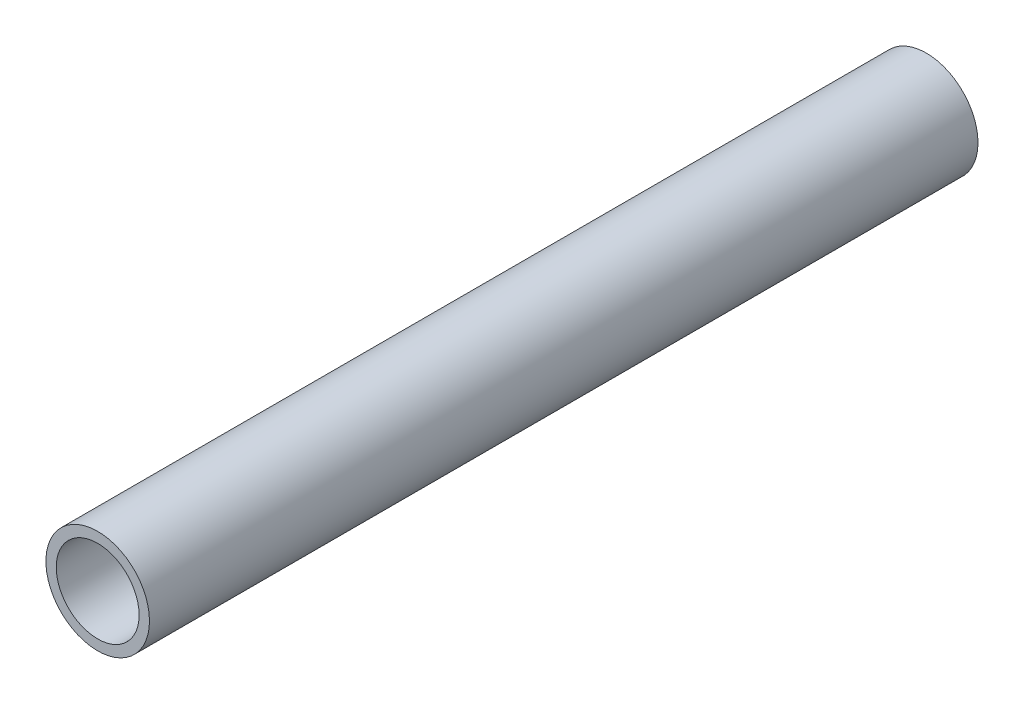
ISO-10303-21;
HEADER;
FILE_DESCRIPTION(('STEP AP214'),'2;1');
FILE_NAME('part.step','',(''),(''),'','','');
FILE_SCHEMA(('AUTOMOTIVE_DESIGN { 1 0 10303 214 1 1 1 1 }'));
ENDSEC;
DATA;
#1=APPLICATION_CONTEXT('core data for automotive mechanical design processes');
#2=APPLICATION_PROTOCOL_DEFINITION('international standard','automotive_design',2000,#1);
#3=PRODUCT_CONTEXT('',#1,'mechanical');
#4=PRODUCT('Part','Part','',(#3));
#5=PRODUCT_RELATED_PRODUCT_CATEGORY('part','',(#4));
#6=PRODUCT_DEFINITION_FORMATION('','',#4);
#7=PRODUCT_DEFINITION_CONTEXT('part definition',#1,'design');
#8=PRODUCT_DEFINITION('design','',#6,#7);
#9=PRODUCT_DEFINITION_SHAPE('','',#8);
#10=(LENGTH_UNIT() NAMED_UNIT(*) SI_UNIT(.MILLI.,.METRE.));
#11=(NAMED_UNIT(*) PLANE_ANGLE_UNIT() SI_UNIT($,.RADIAN.));
#12=(NAMED_UNIT(*) SI_UNIT($,.STERADIAN.) SOLID_ANGLE_UNIT());
#13=UNCERTAINTY_MEASURE_WITH_UNIT(LENGTH_MEASURE(1.E-05),#10,'distance_accuracy_value','');
#14=(GEOMETRIC_REPRESENTATION_CONTEXT(3) GLOBAL_UNCERTAINTY_ASSIGNED_CONTEXT((#13)) GLOBAL_UNIT_ASSIGNED_CONTEXT((#10,
#11,#12)) REPRESENTATION_CONTEXT('',''));
#15=CARTESIAN_POINT('',(0.,0.,0.));
#16=DIRECTION('',(0.,0.,1.));
#17=DIRECTION('',(1.,0.,0.));
#18=AXIS2_PLACEMENT_3D('',#15,#16,#17);
#19=CARTESIAN_POINT('',(0.,0.,203.2));
#20=DIRECTION('',(0.,0.,1.));
#21=DIRECTION('',(1.,0.,0.));
#22=AXIS2_PLACEMENT_3D('',#19,#20,#21);
#23=PLANE('',#22);
#24=CARTESIAN_POINT('',(0.,0.,203.2));
#25=DIRECTION('',(0.,0.,1.));
#26=DIRECTION('',(1.,0.,0.));
#27=AXIS2_PLACEMENT_3D('',#24,#25,#26);
#28=CIRCLE('',#27,12.7);
#29=CARTESIAN_POINT('',(12.7,0.,203.2));
#30=VERTEX_POINT('',#29);
#31=EDGE_CURVE('E10',#30,#30,#28,.T.);
#32=ORIENTED_EDGE('',*,*,#31,.T.);
#33=EDGE_LOOP('',(#32));
#34=FACE_BOUND('',#33,.T.);
#35=CARTESIAN_POINT('',(0.,0.,203.2));
#36=DIRECTION('',(0.,0.,1.));
#37=DIRECTION('',(1.,0.,0.));
#38=AXIS2_PLACEMENT_3D('',#35,#36,#37);
#39=CIRCLE('',#38,10.16);
#40=CARTESIAN_POINT('',(10.16,0.,203.2));
#41=VERTEX_POINT('',#40);
#42=EDGE_CURVE('E41',#41,#41,#39,.T.);
#43=ORIENTED_EDGE('',*,*,#42,.F.);
#44=EDGE_LOOP('',(#43));
#45=FACE_BOUND('',#44,.T.);
#46=ADVANCED_FACE('F30',(#34,#45),#23,.T.);
#47=CARTESIAN_POINT('',(0.,0.,0.));
#48=DIRECTION('',(0.,0.,1.));
#49=DIRECTION('',(1.,0.,0.));
#50=AXIS2_PLACEMENT_3D('',#47,#48,#49);
#51=PLANE('',#50);
#52=CARTESIAN_POINT('',(0.,0.,0.));
#53=DIRECTION('',(0.,0.,1.));
#54=DIRECTION('',(1.,0.,0.));
#55=AXIS2_PLACEMENT_3D('',#52,#53,#54);
#56=CIRCLE('',#55,12.7);
#57=CARTESIAN_POINT('',(12.7,0.,0.));
#58=VERTEX_POINT('',#57);
#59=EDGE_CURVE('E34',#58,#58,#56,.T.);
#60=ORIENTED_EDGE('',*,*,#59,.F.);
#61=EDGE_LOOP('',(#60));
#62=FACE_BOUND('',#61,.T.);
#63=CARTESIAN_POINT('',(0.,0.,0.));
#64=DIRECTION('',(0.,0.,1.));
#65=DIRECTION('',(1.,0.,0.));
#66=AXIS2_PLACEMENT_3D('',#63,#64,#65);
#67=CIRCLE('',#66,10.16);
#68=CARTESIAN_POINT('',(10.16,0.,0.));
#69=VERTEX_POINT('',#68);
#70=EDGE_CURVE('E43',#69,#69,#67,.T.);
#71=ORIENTED_EDGE('',*,*,#70,.T.);
#72=EDGE_LOOP('',(#71));
#73=FACE_BOUND('',#72,.T.);
#74=ADVANCED_FACE('F53',(#62,#73),#51,.F.);
#75=CARTESIAN_POINT('',(0.,0.,203.2));
#76=DIRECTION('',(0.,0.,-1.));
#77=DIRECTION('',(-1.,0.,0.));
#78=AXIS2_PLACEMENT_3D('',#75,#76,#77);
#79=CYLINDRICAL_SURFACE('',#78,12.7);
#80=ORIENTED_EDGE('',*,*,#31,.F.);
#81=EDGE_LOOP('',(#80));
#82=FACE_BOUND('',#81,.T.);
#83=ORIENTED_EDGE('',*,*,#59,.T.);
#84=EDGE_LOOP('',(#83));
#85=FACE_BOUND('',#84,.T.);
#86=ADVANCED_FACE('F32',(#82,#85),#79,.T.);
#87=CARTESIAN_POINT('',(0.,0.,203.2));
#88=DIRECTION('',(0.,0.,-1.));
#89=DIRECTION('',(-1.,0.,0.));
#90=AXIS2_PLACEMENT_3D('',#87,#88,#89);
#91=CYLINDRICAL_SURFACE('',#90,10.16);
#92=ORIENTED_EDGE('',*,*,#42,.T.);
#93=EDGE_LOOP('',(#92));
#94=FACE_BOUND('',#93,.T.);
#95=ORIENTED_EDGE('',*,*,#70,.F.);
#96=EDGE_LOOP('',(#95));
#97=FACE_BOUND('',#96,.T.);
#98=ADVANCED_FACE('F49',(#94,#97),#91,.F.);
#99=CLOSED_SHELL('',(#46,#74,#86,#98));
#100=MANIFOLD_SOLID_BREP('B2',#99);
#101=ADVANCED_BREP_SHAPE_REPRESENTATION('',(#18,#100),#14);
#102=SHAPE_DEFINITION_REPRESENTATION(#9,#101);
ENDSEC;
END-ISO-10303-21;
